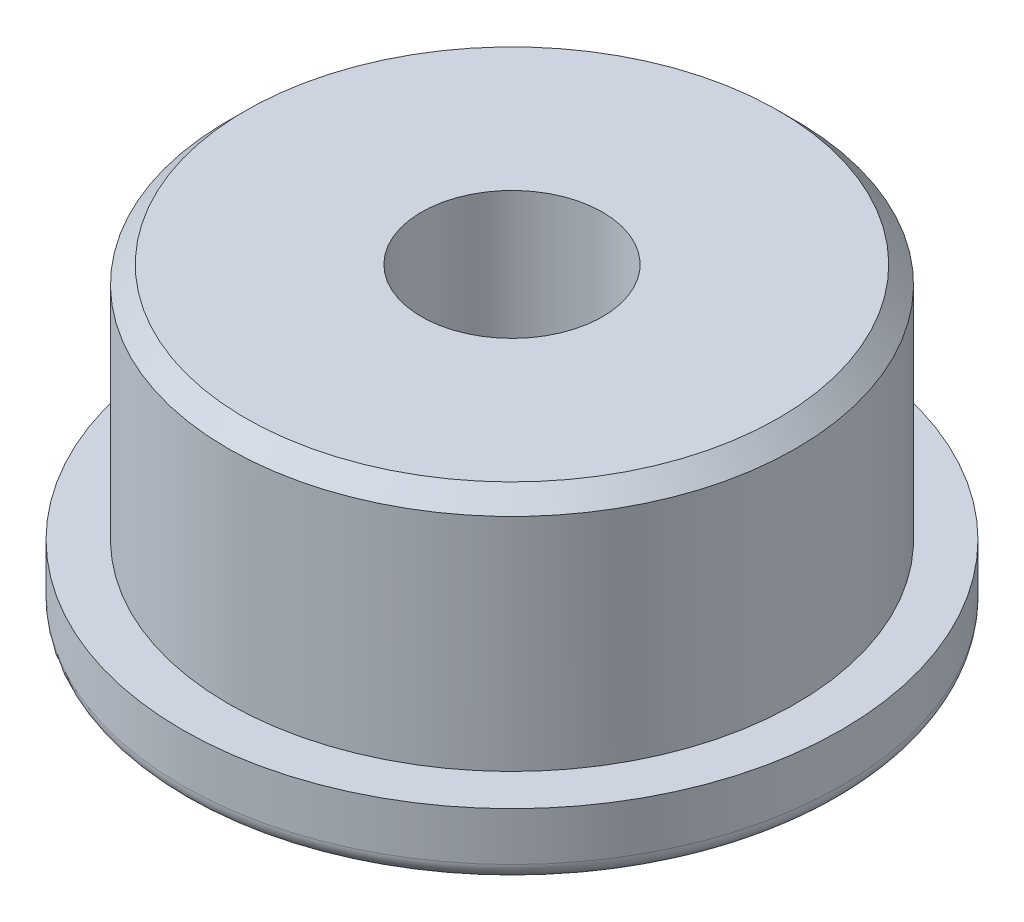
ISO-10303-21;
HEADER;
FILE_DESCRIPTION(('STEP AP214'),'2;1');
FILE_NAME('part.step','',(''),(''),'','','');
FILE_SCHEMA(('AUTOMOTIVE_DESIGN { 1 0 10303 214 1 1 1 1 }'));
ENDSEC;
DATA;
#1=APPLICATION_CONTEXT('core data for automotive mechanical design processes');
#2=APPLICATION_PROTOCOL_DEFINITION('international standard','automotive_design',2000,#1);
#3=PRODUCT_CONTEXT('',#1,'mechanical');
#4=PRODUCT('Part','Part','',(#3));
#5=PRODUCT_RELATED_PRODUCT_CATEGORY('part','',(#4));
#6=PRODUCT_DEFINITION_FORMATION('','',#4);
#7=PRODUCT_DEFINITION_CONTEXT('part definition',#1,'design');
#8=PRODUCT_DEFINITION('design','',#6,#7);
#9=PRODUCT_DEFINITION_SHAPE('','',#8);
#10=(LENGTH_UNIT() NAMED_UNIT(*) SI_UNIT(.MILLI.,.METRE.));
#11=(NAMED_UNIT(*) PLANE_ANGLE_UNIT() SI_UNIT($,.RADIAN.));
#12=(NAMED_UNIT(*) SI_UNIT($,.STERADIAN.) SOLID_ANGLE_UNIT());
#13=UNCERTAINTY_MEASURE_WITH_UNIT(LENGTH_MEASURE(1.E-05),#10,'distance_accuracy_value','');
#14=(GEOMETRIC_REPRESENTATION_CONTEXT(3) GLOBAL_UNCERTAINTY_ASSIGNED_CONTEXT((#13)) GLOBAL_UNIT_ASSIGNED_CONTEXT((#10,
#11,#12)) REPRESENTATION_CONTEXT('',''));
#15=CARTESIAN_POINT('',(0.,0.,0.));
#16=DIRECTION('',(0.,0.,1.));
#17=DIRECTION('',(1.,0.,0.));
#18=AXIS2_PLACEMENT_3D('',#15,#16,#17);
#19=CARTESIAN_POINT('',(0.,24.0791999999999,0.));
#20=DIRECTION('',(0.,-1.,0.));
#21=DIRECTION('',(1.,0.,0.));
#22=AXIS2_PLACEMENT_3D('',#19,#20,#21);
#23=CONICAL_SURFACE('',#22,20.5739999999999,0.785398163397301);
#24=CARTESIAN_POINT('',(0.,24.0792,0.));
#25=DIRECTION('',(0.,1.,0.));
#26=DIRECTION('',(0.,0.,1.));
#27=AXIS2_PLACEMENT_3D('',#24,#25,#26);
#28=CIRCLE('',#27,20.574);
#29=CARTESIAN_POINT('',(0.,24.0792,20.574));
#30=VERTEX_POINT('',#29);
#31=EDGE_CURVE('E64',#30,#30,#28,.F.);
#32=ORIENTED_EDGE('',*,*,#31,.F.);
#33=EDGE_LOOP('',(#32));
#34=FACE_BOUND('',#33,.T.);
#35=CARTESIAN_POINT('',(0.,25.3492000000001,0.));
#36=DIRECTION('',(0.,-1.,0.));
#37=DIRECTION('',(1.,0.,0.));
#38=AXIS2_PLACEMENT_3D('',#35,#36,#37);
#39=CIRCLE('',#38,19.3040000000001);
#40=CARTESIAN_POINT('',(19.3040000000001,25.3492000000001,0.));
#41=VERTEX_POINT('',#40);
#42=EDGE_CURVE('E155',#41,#41,#39,.F.);
#43=ORIENTED_EDGE('',*,*,#42,.F.);
#44=EDGE_LOOP('',(#43));
#45=FACE_BOUND('',#44,.T.);
#46=ADVANCED_FACE('F17',(#34,#45),#23,.T.);
#47=CARTESIAN_POINT('',(0.,25.3492,0.));
#48=DIRECTION('',(0.,1.,0.));
#49=DIRECTION('',(0.,0.,1.));
#50=AXIS2_PLACEMENT_3D('',#47,#48,#49);
#51=PLANE('',#50);
#52=CARTESIAN_POINT('',(0.,25.3492,0.));
#53=DIRECTION('',(0.,-1.,0.));
#54=DIRECTION('',(0.,0.,-1.));
#55=AXIS2_PLACEMENT_3D('',#52,#53,#54);
#56=CIRCLE('',#55,6.5659);
#57=CARTESIAN_POINT('',(0.,25.3492,-6.5659));
#58=VERTEX_POINT('',#57);
#59=EDGE_CURVE('E165',#58,#58,#56,.T.);
#60=ORIENTED_EDGE('',*,*,#59,.T.);
#61=EDGE_LOOP('',(#60));
#62=FACE_BOUND('',#61,.T.);
#63=ORIENTED_EDGE('',*,*,#42,.T.);
#64=EDGE_LOOP('',(#63));
#65=FACE_BOUND('',#64,.T.);
#66=ADVANCED_FACE('F115',(#62,#65),#51,.T.);
#67=CARTESIAN_POINT('',(0.,8.0772,0.));
#68=DIRECTION('',(0.,1.,0.));
#69=DIRECTION('',(0.,0.,1.));
#70=AXIS2_PLACEMENT_3D('',#67,#68,#69);
#71=CYLINDRICAL_SURFACE('',#70,20.574);
#72=CARTESIAN_POINT('',(0.,8.0772,0.));
#73=DIRECTION('',(0.,1.,0.));
#74=DIRECTION('',(0.,0.,1.));
#75=AXIS2_PLACEMENT_3D('',#72,#73,#74);
#76=CIRCLE('',#75,20.574);
#77=CARTESIAN_POINT('',(0.,8.0772,20.574));
#78=VERTEX_POINT('',#77);
#79=EDGE_CURVE('E167',#78,#78,#76,.F.);
#80=ORIENTED_EDGE('',*,*,#79,.F.);
#81=EDGE_LOOP('',(#80));
#82=FACE_BOUND('',#81,.T.);
#83=ORIENTED_EDGE('',*,*,#31,.T.);
#84=EDGE_LOOP('',(#83));
#85=FACE_BOUND('',#84,.T.);
#86=ADVANCED_FACE('F112',(#82,#85),#71,.T.);
#87=CARTESIAN_POINT('',(0.,0.,0.));
#88=DIRECTION('',(0.,-1.,0.));
#89=DIRECTION('',(0.,0.,-1.));
#90=AXIS2_PLACEMENT_3D('',#87,#88,#89);
#91=CYLINDRICAL_SURFACE('',#90,6.5659);
#92=ORIENTED_EDGE('',*,*,#59,.F.);
#93=EDGE_LOOP('',(#92));
#94=FACE_BOUND('',#93,.T.);
#95=CARTESIAN_POINT('',(0.,0.,0.));
#96=DIRECTION('',(0.,-1.,0.));
#97=DIRECTION('',(0.,0.,-1.));
#98=AXIS2_PLACEMENT_3D('',#95,#96,#97);
#99=CIRCLE('',#98,6.5659);
#100=CARTESIAN_POINT('',(0.,0.,-6.5659));
#101=VERTEX_POINT('',#100);
#102=EDGE_CURVE('E170',#101,#101,#99,.T.);
#103=ORIENTED_EDGE('',*,*,#102,.T.);
#104=EDGE_LOOP('',(#103));
#105=FACE_BOUND('',#104,.T.);
#106=ADVANCED_FACE('F108',(#94,#105),#91,.F.);
#107=CARTESIAN_POINT('',(0.,8.0772,0.));
#108=DIRECTION('',(0.,1.,0.));
#109=DIRECTION('',(0.,0.,1.));
#110=AXIS2_PLACEMENT_3D('',#107,#108,#109);
#111=PLANE('',#110);
#112=ORIENTED_EDGE('',*,*,#79,.T.);
#113=EDGE_LOOP('',(#112));
#114=FACE_BOUND('',#113,.T.);
#115=CARTESIAN_POINT('',(0.,8.0772,0.));
#116=DIRECTION('',(0.,1.,0.));
#117=DIRECTION('',(0.,0.,1.));
#118=AXIS2_PLACEMENT_3D('',#115,#116,#117);
#119=CIRCLE('',#118,23.876);
#120=CARTESIAN_POINT('',(0.,8.0772,23.876));
#121=VERTEX_POINT('',#120);
#122=EDGE_CURVE('E51',#121,#121,#119,.F.);
#123=ORIENTED_EDGE('',*,*,#122,.F.);
#124=EDGE_LOOP('',(#123));
#125=FACE_BOUND('',#124,.T.);
#126=ADVANCED_FACE('F103',(#114,#125),#111,.T.);
#127=CARTESIAN_POINT('',(0.,0.,0.));
#128=DIRECTION('',(0.,1.,0.));
#129=DIRECTION('',(0.,0.,1.));
#130=AXIS2_PLACEMENT_3D('',#127,#128,#129);
#131=PLANE('',#130);
#132=ORIENTED_EDGE('',*,*,#102,.F.);
#133=EDGE_LOOP('',(#132));
#134=FACE_BOUND('',#133,.T.);
#135=CARTESIAN_POINT('',(0.,0.,0.));
#136=DIRECTION('',(0.,1.,0.));
#137=DIRECTION('',(-1.,0.,0.));
#138=AXIS2_PLACEMENT_3D('',#135,#136,#137);
#139=CIRCLE('',#138,11.3538);
#140=CARTESIAN_POINT('',(-11.3538,0.,0.));
#141=VERTEX_POINT('',#140);
#142=CARTESIAN_POINT('',(11.3538,0.,0.));
#143=VERTEX_POINT('',#142);
#144=EDGE_CURVE('E49',#141,#143,#139,.T.);
#145=ORIENTED_EDGE('',*,*,#144,.F.);
#146=CARTESIAN_POINT('',(0.,0.,0.));
#147=DIRECTION('',(0.,1.,0.));
#148=DIRECTION('',(1.,0.,0.));
#149=AXIS2_PLACEMENT_3D('',#146,#147,#148);
#150=CIRCLE('',#149,11.3538);
#151=EDGE_CURVE('E44',#143,#141,#150,.T.);
#152=ORIENTED_EDGE('',*,*,#151,.F.);
#153=EDGE_LOOP('',(#145,#152));
#154=FACE_BOUND('',#153,.T.);
#155=ADVANCED_FACE('F48',(#134,#154),#131,.F.);
#156=CARTESIAN_POINT('',(0.,3.302,0.));
#157=DIRECTION('',(0.,1.,0.));
#158=DIRECTION('',(0.,0.,1.));
#159=AXIS2_PLACEMENT_3D('',#156,#157,#158);
#160=CYLINDRICAL_SURFACE('',#159,23.876);
#161=ORIENTED_EDGE('',*,*,#122,.T.);
#162=EDGE_LOOP('',(#161));
#163=FACE_BOUND('',#162,.T.);
#164=CARTESIAN_POINT('',(0.,4.572,0.));
#165=DIRECTION('',(0.,1.,0.));
#166=DIRECTION('',(-0.00660017862829215,0.,-0.999978218583822));
#167=AXIS2_PLACEMENT_3D('',#164,#165,#166);
#168=CIRCLE('',#167,23.876);
#169=CARTESIAN_POINT('',(-0.157585864929103,4.572,-23.8754799469073));
#170=VERTEX_POINT('',#169);
#171=EDGE_CURVE('E56',#170,#170,#168,.F.);
#172=ORIENTED_EDGE('',*,*,#171,.F.);
#173=EDGE_LOOP('',(#172));
#174=FACE_BOUND('',#173,.T.);
#175=ADVANCED_FACE('F76',(#163,#174),#160,.T.);
#176=CARTESIAN_POINT('',(0.,1.27,0.));
#177=DIRECTION('',(0.,1.,0.));
#178=DIRECTION('',(0.999922084299473,0.,-0.0124830016501797));
#179=AXIS2_PLACEMENT_3D('',#176,#177,#178);
#180=TOROIDAL_SURFACE('',#179,11.3538,1.27);
#181=CARTESIAN_POINT('',(0.,1.27,0.));
#182=DIRECTION('',(0.,1.,0.));
#183=DIRECTION('',(0.,0.,1.));
#184=AXIS2_PLACEMENT_3D('',#181,#182,#183);
#185=CIRCLE('',#184,12.6238);
#186=CARTESIAN_POINT('',(0.,1.27,12.6238));
#187=VERTEX_POINT('',#186);
#188=EDGE_CURVE('E88',#187,#187,#185,.T.);
#189=ORIENTED_EDGE('',*,*,#188,.F.);
#190=EDGE_LOOP('',(#189));
#191=FACE_BOUND('',#190,.T.);
#192=ORIENTED_EDGE('',*,*,#144,.T.);
#193=ORIENTED_EDGE('',*,*,#151,.T.);
#194=EDGE_LOOP('',(#192,#193));
#195=FACE_BOUND('',#194,.T.);
#196=ADVANCED_FACE('F55',(#191,#195),#180,.T.);
#197=CARTESIAN_POINT('',(0.,4.572,0.));
#198=DIRECTION('',(0.,1.,0.));
#199=DIRECTION('',(-0.00660017862829215,0.,-0.999978218583822));
#200=AXIS2_PLACEMENT_3D('',#197,#198,#199);
#201=TOROIDAL_SURFACE('',#200,22.606,1.27);
#202=ORIENTED_EDGE('',*,*,#171,.T.);
#203=EDGE_LOOP('',(#202));
#204=FACE_BOUND('',#203,.T.);
#205=CARTESIAN_POINT('',(0.,3.302,0.));
#206=DIRECTION('',(0.,1.,0.));
#207=DIRECTION('',(0.,0.,1.));
#208=AXIS2_PLACEMENT_3D('',#205,#206,#207);
#209=CIRCLE('',#208,22.606);
#210=CARTESIAN_POINT('',(0.,3.302,22.606));
#211=VERTEX_POINT('',#210);
#212=CARTESIAN_POINT('',(0.,3.302,-22.606));
#213=VERTEX_POINT('',#212);
#214=EDGE_CURVE('E28',#211,#213,#209,.T.);
#215=ORIENTED_EDGE('',*,*,#214,.T.);
#216=CARTESIAN_POINT('',(0.,3.302,0.));
#217=DIRECTION('',(0.,1.,0.));
#218=DIRECTION('',(0.,0.,-1.));
#219=AXIS2_PLACEMENT_3D('',#216,#217,#218);
#220=CIRCLE('',#219,22.606);
#221=EDGE_CURVE('E91',#213,#211,#220,.T.);
#222=ORIENTED_EDGE('',*,*,#221,.T.);
#223=EDGE_LOOP('',(#215,#222));
#224=FACE_BOUND('',#223,.T.);
#225=ADVANCED_FACE('F75',(#204,#224),#201,.T.);
#226=CARTESIAN_POINT('',(0.,0.,0.));
#227=DIRECTION('',(0.,1.,0.));
#228=DIRECTION('',(0.,0.,1.));
#229=AXIS2_PLACEMENT_3D('',#226,#227,#228);
#230=CYLINDRICAL_SURFACE('',#229,12.6238);
#231=CARTESIAN_POINT('',(0.,3.302,0.));
#232=DIRECTION('',(0.,1.,0.));
#233=DIRECTION('',(0.,0.,1.));
#234=AXIS2_PLACEMENT_3D('',#231,#232,#233);
#235=CIRCLE('',#234,12.6238);
#236=CARTESIAN_POINT('',(0.,3.302,12.6238));
#237=VERTEX_POINT('',#236);
#238=EDGE_CURVE('E11',#237,#237,#235,.F.);
#239=ORIENTED_EDGE('',*,*,#238,.T.);
#240=EDGE_LOOP('',(#239));
#241=FACE_BOUND('',#240,.T.);
#242=ORIENTED_EDGE('',*,*,#188,.T.);
#243=EDGE_LOOP('',(#242));
#244=FACE_BOUND('',#243,.T.);
#245=ADVANCED_FACE('F128',(#241,#244),#230,.T.);
#246=CARTESIAN_POINT('',(0.,3.302,0.));
#247=DIRECTION('',(0.,1.,0.));
#248=DIRECTION('',(0.,0.,1.));
#249=AXIS2_PLACEMENT_3D('',#246,#247,#248);
#250=PLANE('',#249);
#251=ORIENTED_EDGE('',*,*,#238,.F.);
#252=EDGE_LOOP('',(#251));
#253=FACE_BOUND('',#252,.T.);
#254=ORIENTED_EDGE('',*,*,#221,.F.);
#255=ORIENTED_EDGE('',*,*,#214,.F.);
#256=EDGE_LOOP('',(#254,#255));
#257=FACE_BOUND('',#256,.T.);
#258=ADVANCED_FACE('F126',(#253,#257),#250,.F.);
#259=CLOSED_SHELL('',(#46,#66,#86,#106,#126,#155,#175,#196,#225,#245,#258));
#260=MANIFOLD_SOLID_BREP('B1',#259);
#261=ADVANCED_BREP_SHAPE_REPRESENTATION('',(#18,#260),#14);
#262=SHAPE_DEFINITION_REPRESENTATION(#9,#261);
ENDSEC;
END-ISO-10303-21;
